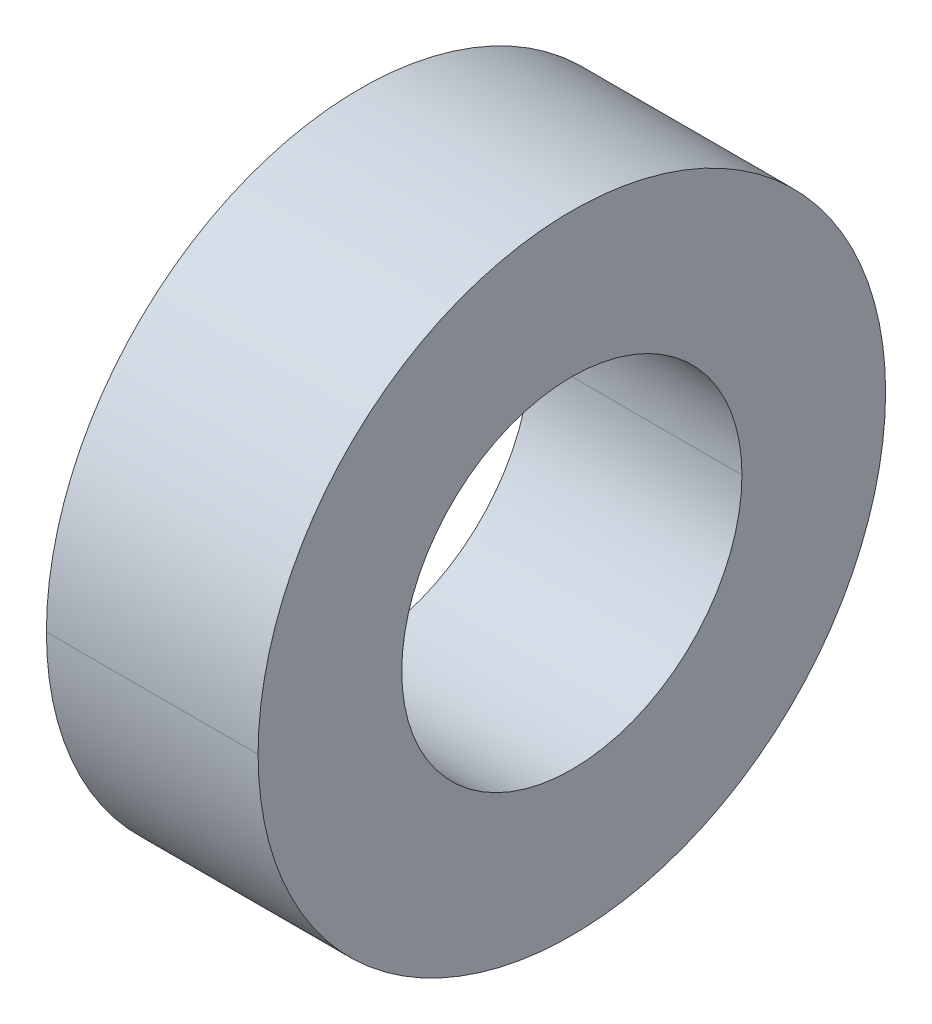
ISO-10303-21;
HEADER;
FILE_DESCRIPTION(('STEP AP214'),'2;1');
FILE_NAME('part.step','',(''),(''),'','','');
FILE_SCHEMA(('AUTOMOTIVE_DESIGN { 1 0 10303 214 1 1 1 1 }'));
ENDSEC;
DATA;
#1=APPLICATION_CONTEXT('core data for automotive mechanical design processes');
#2=APPLICATION_PROTOCOL_DEFINITION('international standard','automotive_design',2000,#1);
#3=PRODUCT_CONTEXT('',#1,'mechanical');
#4=PRODUCT('Part','Part','',(#3));
#5=PRODUCT_RELATED_PRODUCT_CATEGORY('part','',(#4));
#6=PRODUCT_DEFINITION_FORMATION('','',#4);
#7=PRODUCT_DEFINITION_CONTEXT('part definition',#1,'design');
#8=PRODUCT_DEFINITION('design','',#6,#7);
#9=PRODUCT_DEFINITION_SHAPE('','',#8);
#10=(LENGTH_UNIT() NAMED_UNIT(*) SI_UNIT(.MILLI.,.METRE.));
#11=(NAMED_UNIT(*) PLANE_ANGLE_UNIT() SI_UNIT($,.RADIAN.));
#12=(NAMED_UNIT(*) SI_UNIT($,.STERADIAN.) SOLID_ANGLE_UNIT());
#13=UNCERTAINTY_MEASURE_WITH_UNIT(LENGTH_MEASURE(1.E-05),#10,'distance_accuracy_value','');
#14=(GEOMETRIC_REPRESENTATION_CONTEXT(3) GLOBAL_UNCERTAINTY_ASSIGNED_CONTEXT((#13)) GLOBAL_UNIT_ASSIGNED_CONTEXT((#10,
#11,#12)) REPRESENTATION_CONTEXT('',''));
#15=CARTESIAN_POINT('',(0.,0.,0.));
#16=DIRECTION('',(0.,0.,1.));
#17=DIRECTION('',(1.,0.,0.));
#18=AXIS2_PLACEMENT_3D('',#15,#16,#17);
#19=CARTESIAN_POINT('',(-1.4,4.15,0.));
#20=DIRECTION('',(-1.,0.,0.));
#21=DIRECTION('',(0.,0.,1.));
#22=AXIS2_PLACEMENT_3D('',#19,#20,#21);
#23=PLANE('',#22);
#24=CARTESIAN_POINT('',(-1.4,0.,0.));
#25=DIRECTION('',(1.,0.,0.));
#26=DIRECTION('',(0.,0.,-1.));
#27=AXIS2_PLACEMENT_3D('',#24,#25,#26);
#28=CIRCLE('',#27,2.25);
#29=CARTESIAN_POINT('',(-1.4,0.,-2.25));
#30=VERTEX_POINT('',#29);
#31=CARTESIAN_POINT('',(-1.4,0.,2.25));
#32=VERTEX_POINT('',#31);
#33=EDGE_CURVE('E11',#30,#32,#28,.T.);
#34=ORIENTED_EDGE('',*,*,#33,.T.);
#35=CARTESIAN_POINT('',(-1.4,0.,0.));
#36=DIRECTION('',(1.,0.,0.));
#37=DIRECTION('',(0.,0.,-1.));
#38=AXIS2_PLACEMENT_3D('',#35,#36,#37);
#39=CIRCLE('',#38,2.25);
#40=EDGE_CURVE('E25',#32,#30,#39,.T.);
#41=ORIENTED_EDGE('',*,*,#40,.T.);
#42=EDGE_LOOP('',(#34,#41));
#43=FACE_BOUND('',#42,.T.);
#44=CARTESIAN_POINT('',(-1.4,0.,0.));
#45=DIRECTION('',(1.,0.,0.));
#46=DIRECTION('',(0.,0.,-1.));
#47=AXIS2_PLACEMENT_3D('',#44,#45,#46);
#48=CIRCLE('',#47,4.15);
#49=CARTESIAN_POINT('',(-1.4,0.,4.15));
#50=VERTEX_POINT('',#49);
#51=CARTESIAN_POINT('',(-1.4,0.,-4.15));
#52=VERTEX_POINT('',#51);
#53=EDGE_CURVE('E95',#50,#52,#48,.T.);
#54=ORIENTED_EDGE('',*,*,#53,.F.);
#55=CARTESIAN_POINT('',(-1.4,0.,0.));
#56=DIRECTION('',(1.,0.,0.));
#57=DIRECTION('',(0.,0.,-1.));
#58=AXIS2_PLACEMENT_3D('',#55,#56,#57);
#59=CIRCLE('',#58,4.15);
#60=EDGE_CURVE('E90',#52,#50,#59,.T.);
#61=ORIENTED_EDGE('',*,*,#60,.F.);
#62=EDGE_LOOP('',(#54,#61));
#63=FACE_BOUND('',#62,.T.);
#64=ADVANCED_FACE('F17',(#43,#63),#23,.T.);
#65=CARTESIAN_POINT('',(1.4,0.,0.));
#66=DIRECTION('',(1.,0.,0.));
#67=DIRECTION('',(0.,-1.,0.));
#68=AXIS2_PLACEMENT_3D('',#65,#66,#67);
#69=CYLINDRICAL_SURFACE('',#68,4.15);
#70=DIRECTION('',(1.,0.,0.));
#71=VECTOR('',#70,1.);
#72=CARTESIAN_POINT('',(-1.4,0.,4.15));
#73=LINE('',#72,#71);
#74=CARTESIAN_POINT('',(1.4,0.,4.15));
#75=VERTEX_POINT('',#74);
#76=EDGE_CURVE('E86',#50,#75,#73,.T.);
#77=ORIENTED_EDGE('',*,*,#76,.T.);
#78=CARTESIAN_POINT('',(1.4,0.,0.));
#79=DIRECTION('',(1.,0.,0.));
#80=DIRECTION('',(0.,0.,-1.));
#81=AXIS2_PLACEMENT_3D('',#78,#79,#80);
#82=CIRCLE('',#81,4.15);
#83=CARTESIAN_POINT('',(1.4,0.,-4.15));
#84=VERTEX_POINT('',#83);
#85=EDGE_CURVE('E81',#84,#75,#82,.T.);
#86=ORIENTED_EDGE('',*,*,#85,.F.);
#87=DIRECTION('',(1.,0.,0.));
#88=VECTOR('',#87,1.);
#89=CARTESIAN_POINT('',(-1.4,0.,-4.15));
#90=LINE('',#89,#88);
#91=EDGE_CURVE('E70',#52,#84,#90,.T.);
#92=ORIENTED_EDGE('',*,*,#91,.F.);
#93=ORIENTED_EDGE('',*,*,#60,.T.);
#94=EDGE_LOOP('',(#77,#86,#92,#93));
#95=FACE_BOUND('',#94,.T.);
#96=ADVANCED_FACE('F111',(#95),#69,.T.);
#97=CARTESIAN_POINT('',(1.4,0.,0.));
#98=DIRECTION('',(1.,0.,0.));
#99=DIRECTION('',(0.,1.,0.));
#100=AXIS2_PLACEMENT_3D('',#97,#98,#99);
#101=CYLINDRICAL_SURFACE('',#100,4.15);
#102=ORIENTED_EDGE('',*,*,#76,.F.);
#103=ORIENTED_EDGE('',*,*,#53,.T.);
#104=ORIENTED_EDGE('',*,*,#91,.T.);
#105=CARTESIAN_POINT('',(1.4,0.,0.));
#106=DIRECTION('',(1.,0.,0.));
#107=DIRECTION('',(0.,0.,-1.));
#108=AXIS2_PLACEMENT_3D('',#105,#106,#107);
#109=CIRCLE('',#108,4.15);
#110=EDGE_CURVE('E67',#75,#84,#109,.T.);
#111=ORIENTED_EDGE('',*,*,#110,.F.);
#112=EDGE_LOOP('',(#102,#103,#104,#111));
#113=FACE_BOUND('',#112,.T.);
#114=ADVANCED_FACE('F106',(#113),#101,.T.);
#115=CARTESIAN_POINT('',(1.4,2.25,0.));
#116=DIRECTION('',(1.,0.,0.));
#117=DIRECTION('',(0.,0.,-1.));
#118=AXIS2_PLACEMENT_3D('',#115,#116,#117);
#119=PLANE('',#118);
#120=ORIENTED_EDGE('',*,*,#85,.T.);
#121=ORIENTED_EDGE('',*,*,#110,.T.);
#122=EDGE_LOOP('',(#120,#121));
#123=FACE_BOUND('',#122,.T.);
#124=CARTESIAN_POINT('',(1.4,0.,0.));
#125=DIRECTION('',(1.,0.,0.));
#126=DIRECTION('',(0.,0.,-1.));
#127=AXIS2_PLACEMENT_3D('',#124,#125,#126);
#128=CIRCLE('',#127,2.25);
#129=CARTESIAN_POINT('',(1.4,0.,2.25));
#130=VERTEX_POINT('',#129);
#131=CARTESIAN_POINT('',(1.4,0.,-2.25));
#132=VERTEX_POINT('',#131);
#133=EDGE_CURVE('E55',#130,#132,#128,.T.);
#134=ORIENTED_EDGE('',*,*,#133,.F.);
#135=CARTESIAN_POINT('',(1.4,0.,0.));
#136=DIRECTION('',(1.,0.,0.));
#137=DIRECTION('',(0.,0.,-1.));
#138=AXIS2_PLACEMENT_3D('',#135,#136,#137);
#139=CIRCLE('',#138,2.25);
#140=EDGE_CURVE('E51',#132,#130,#139,.T.);
#141=ORIENTED_EDGE('',*,*,#140,.F.);
#142=EDGE_LOOP('',(#134,#141));
#143=FACE_BOUND('',#142,.T.);
#144=ADVANCED_FACE('F53',(#123,#143),#119,.T.);
#145=CARTESIAN_POINT('',(1.4,0.,0.));
#146=DIRECTION('',(1.,0.,0.));
#147=DIRECTION('',(0.,-1.,0.));
#148=AXIS2_PLACEMENT_3D('',#145,#146,#147);
#149=CYLINDRICAL_SURFACE('',#148,2.25);
#150=DIRECTION('',(1.,0.,0.));
#151=VECTOR('',#150,1.);
#152=CARTESIAN_POINT('',(-1.4,0.,2.25));
#153=LINE('',#152,#151);
#154=EDGE_CURVE('E59',#32,#130,#153,.T.);
#155=ORIENTED_EDGE('',*,*,#154,.F.);
#156=ORIENTED_EDGE('',*,*,#33,.F.);
#157=DIRECTION('',(1.,0.,0.));
#158=VECTOR('',#157,1.);
#159=CARTESIAN_POINT('',(-1.4,0.,-2.25));
#160=LINE('',#159,#158);
#161=EDGE_CURVE('E62',#30,#132,#160,.T.);
#162=ORIENTED_EDGE('',*,*,#161,.T.);
#163=ORIENTED_EDGE('',*,*,#140,.T.);
#164=EDGE_LOOP('',(#155,#156,#162,#163));
#165=FACE_BOUND('',#164,.T.);
#166=ADVANCED_FACE('F63',(#165),#149,.F.);
#167=CARTESIAN_POINT('',(1.4,0.,0.));
#168=DIRECTION('',(1.,0.,0.));
#169=DIRECTION('',(0.,1.,0.));
#170=AXIS2_PLACEMENT_3D('',#167,#168,#169);
#171=CYLINDRICAL_SURFACE('',#170,2.25);
#172=ORIENTED_EDGE('',*,*,#154,.T.);
#173=ORIENTED_EDGE('',*,*,#133,.T.);
#174=ORIENTED_EDGE('',*,*,#161,.F.);
#175=ORIENTED_EDGE('',*,*,#40,.F.);
#176=EDGE_LOOP('',(#172,#173,#174,#175));
#177=FACE_BOUND('',#176,.T.);
#178=ADVANCED_FACE('F66',(#177),#171,.F.);
#179=CLOSED_SHELL('',(#64,#96,#114,#144,#166,#178));
#180=MANIFOLD_SOLID_BREP('B1',#179);
#181=ADVANCED_BREP_SHAPE_REPRESENTATION('',(#18,#180),#14);
#182=SHAPE_DEFINITION_REPRESENTATION(#9,#181);
ENDSEC;
END-ISO-10303-21;
